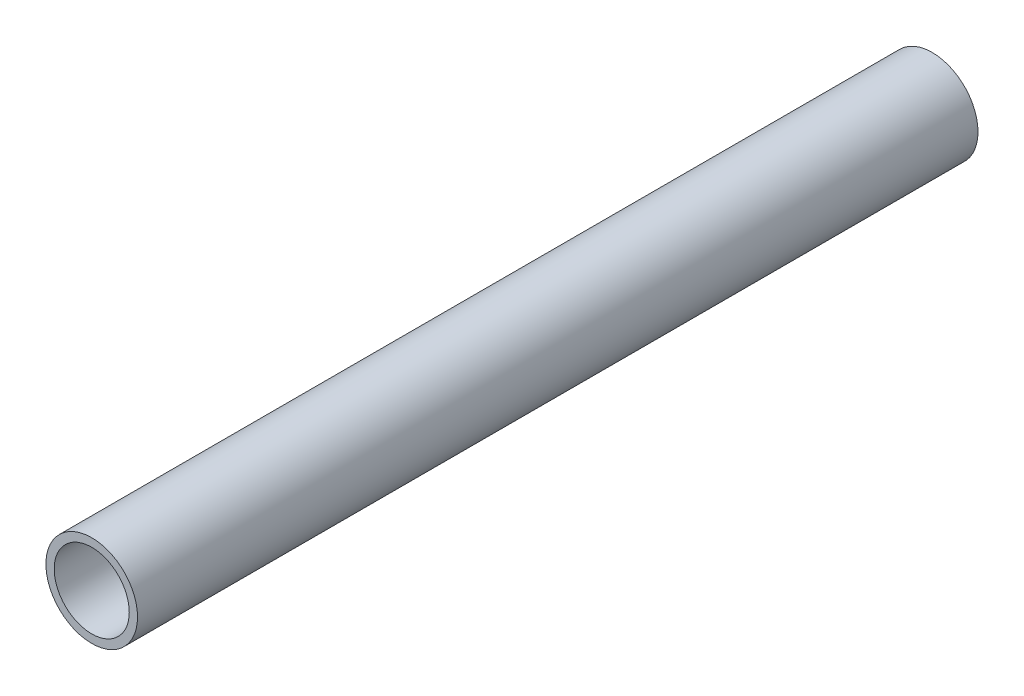
ISO-10303-21;
HEADER;
FILE_DESCRIPTION(('STEP AP214'),'2;1');
FILE_NAME('part.step','',(''),(''),'','','');
FILE_SCHEMA(('AUTOMOTIVE_DESIGN { 1 0 10303 214 1 1 1 1 }'));
ENDSEC;
DATA;
#1=APPLICATION_CONTEXT('core data for automotive mechanical design processes');
#2=APPLICATION_PROTOCOL_DEFINITION('international standard','automotive_design',2000,#1);
#3=PRODUCT_CONTEXT('',#1,'mechanical');
#4=PRODUCT('Part','Part','',(#3));
#5=PRODUCT_RELATED_PRODUCT_CATEGORY('part','',(#4));
#6=PRODUCT_DEFINITION_FORMATION('','',#4);
#7=PRODUCT_DEFINITION_CONTEXT('part definition',#1,'design');
#8=PRODUCT_DEFINITION('design','',#6,#7);
#9=PRODUCT_DEFINITION_SHAPE('','',#8);
#10=(LENGTH_UNIT() NAMED_UNIT(*) SI_UNIT(.MILLI.,.METRE.));
#11=(NAMED_UNIT(*) PLANE_ANGLE_UNIT() SI_UNIT($,.RADIAN.));
#12=(NAMED_UNIT(*) SI_UNIT($,.STERADIAN.) SOLID_ANGLE_UNIT());
#13=UNCERTAINTY_MEASURE_WITH_UNIT(LENGTH_MEASURE(1.E-05),#10,'distance_accuracy_value','');
#14=(GEOMETRIC_REPRESENTATION_CONTEXT(3) GLOBAL_UNCERTAINTY_ASSIGNED_CONTEXT((#13)) GLOBAL_UNIT_ASSIGNED_CONTEXT((#10,
#11,#12)) REPRESENTATION_CONTEXT('',''));
#15=CARTESIAN_POINT('',(0.,0.,0.));
#16=DIRECTION('',(0.,0.,1.));
#17=DIRECTION('',(1.,0.,0.));
#18=AXIS2_PLACEMENT_3D('',#15,#16,#17);
#19=CARTESIAN_POINT('',(0.,0.,142.2));
#20=DIRECTION('',(0.,0.,1.));
#21=DIRECTION('',(1.,0.,0.));
#22=AXIS2_PLACEMENT_3D('',#19,#20,#21);
#23=PLANE('',#22);
#24=CARTESIAN_POINT('',(0.,0.,142.2));
#25=DIRECTION('',(0.,0.,1.));
#26=DIRECTION('',(1.,0.,0.));
#27=AXIS2_PLACEMENT_3D('',#24,#25,#26);
#28=CIRCLE('',#27,7.75);
#29=CARTESIAN_POINT('',(7.75,0.,142.2));
#30=VERTEX_POINT('',#29);
#31=EDGE_CURVE('E10',#30,#30,#28,.T.);
#32=ORIENTED_EDGE('',*,*,#31,.T.);
#33=EDGE_LOOP('',(#32));
#34=FACE_BOUND('',#33,.T.);
#35=CARTESIAN_POINT('',(0.,0.,142.2));
#36=DIRECTION('',(0.,0.,1.));
#37=DIRECTION('',(1.,0.,0.));
#38=AXIS2_PLACEMENT_3D('',#35,#36,#37);
#39=CIRCLE('',#38,6.35);
#40=CARTESIAN_POINT('',(6.35,0.,142.2));
#41=VERTEX_POINT('',#40);
#42=EDGE_CURVE('E45',#41,#41,#39,.T.);
#43=ORIENTED_EDGE('',*,*,#42,.F.);
#44=EDGE_LOOP('',(#43));
#45=FACE_BOUND('',#44,.T.);
#46=ADVANCED_FACE('F34',(#34,#45),#23,.T.);
#47=CARTESIAN_POINT('',(0.,0.,0.));
#48=DIRECTION('',(0.,0.,1.));
#49=DIRECTION('',(1.,0.,0.));
#50=AXIS2_PLACEMENT_3D('',#47,#48,#49);
#51=PLANE('',#50);
#52=CARTESIAN_POINT('',(0.,0.,0.));
#53=DIRECTION('',(0.,0.,1.));
#54=DIRECTION('',(1.,0.,0.));
#55=AXIS2_PLACEMENT_3D('',#52,#53,#54);
#56=CIRCLE('',#55,7.75);
#57=CARTESIAN_POINT('',(7.75,0.,0.));
#58=VERTEX_POINT('',#57);
#59=EDGE_CURVE('E38',#58,#58,#56,.T.);
#60=ORIENTED_EDGE('',*,*,#59,.F.);
#61=EDGE_LOOP('',(#60));
#62=FACE_BOUND('',#61,.T.);
#63=CARTESIAN_POINT('',(0.,0.,0.));
#64=DIRECTION('',(0.,0.,1.));
#65=DIRECTION('',(1.,0.,0.));
#66=AXIS2_PLACEMENT_3D('',#63,#64,#65);
#67=CIRCLE('',#66,6.35);
#68=CARTESIAN_POINT('',(6.35,0.,0.));
#69=VERTEX_POINT('',#68);
#70=EDGE_CURVE('E47',#69,#69,#67,.T.);
#71=ORIENTED_EDGE('',*,*,#70,.T.);
#72=EDGE_LOOP('',(#71));
#73=FACE_BOUND('',#72,.T.);
#74=ADVANCED_FACE('F57',(#62,#73),#51,.F.);
#75=CARTESIAN_POINT('',(0.,0.,142.2));
#76=DIRECTION('',(0.,0.,-1.));
#77=DIRECTION('',(-1.,0.,0.));
#78=AXIS2_PLACEMENT_3D('',#75,#76,#77);
#79=CYLINDRICAL_SURFACE('',#78,7.75);
#80=ORIENTED_EDGE('',*,*,#31,.F.);
#81=EDGE_LOOP('',(#80));
#82=FACE_BOUND('',#81,.T.);
#83=ORIENTED_EDGE('',*,*,#59,.T.);
#84=EDGE_LOOP('',(#83));
#85=FACE_BOUND('',#84,.T.);
#86=ADVANCED_FACE('F36',(#82,#85),#79,.T.);
#87=CARTESIAN_POINT('',(0.,0.,142.2));
#88=DIRECTION('',(0.,0.,-1.));
#89=DIRECTION('',(-1.,0.,0.));
#90=AXIS2_PLACEMENT_3D('',#87,#88,#89);
#91=CYLINDRICAL_SURFACE('',#90,6.35);
#92=ORIENTED_EDGE('',*,*,#42,.T.);
#93=EDGE_LOOP('',(#92));
#94=FACE_BOUND('',#93,.T.);
#95=ORIENTED_EDGE('',*,*,#70,.F.);
#96=EDGE_LOOP('',(#95));
#97=FACE_BOUND('',#96,.T.);
#98=ADVANCED_FACE('F53',(#94,#97),#91,.F.);
#99=CLOSED_SHELL('',(#46,#74,#86,#98));
#100=MANIFOLD_SOLID_BREP('B2',#99);
#101=ADVANCED_BREP_SHAPE_REPRESENTATION('',(#18,#100),#14);
#102=SHAPE_DEFINITION_REPRESENTATION(#9,#101);
ENDSEC;
END-ISO-10303-21;
